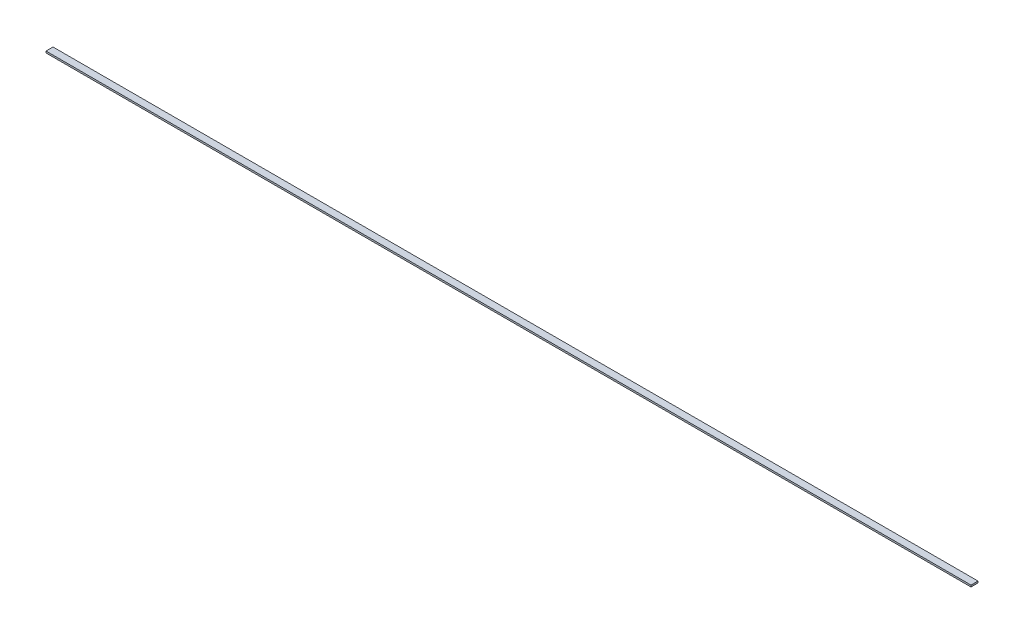
ISO-10303-21;
HEADER;
FILE_DESCRIPTION(('STEP AP214'),'2;1');
FILE_NAME('part.step','',(''),(''),'','','');
FILE_SCHEMA(('AUTOMOTIVE_DESIGN { 1 0 10303 214 1 1 1 1 }'));
ENDSEC;
DATA;
#1=APPLICATION_CONTEXT('core data for automotive mechanical design processes');
#2=APPLICATION_PROTOCOL_DEFINITION('international standard','automotive_design',2000,#1);
#3=PRODUCT_CONTEXT('',#1,'mechanical');
#4=PRODUCT('Part','Part','',(#3));
#5=PRODUCT_RELATED_PRODUCT_CATEGORY('part','',(#4));
#6=PRODUCT_DEFINITION_FORMATION('','',#4);
#7=PRODUCT_DEFINITION_CONTEXT('part definition',#1,'design');
#8=PRODUCT_DEFINITION('design','',#6,#7);
#9=PRODUCT_DEFINITION_SHAPE('','',#8);
#10=(LENGTH_UNIT() NAMED_UNIT(*) SI_UNIT(.MILLI.,.METRE.));
#11=(NAMED_UNIT(*) PLANE_ANGLE_UNIT() SI_UNIT($,.RADIAN.));
#12=(NAMED_UNIT(*) SI_UNIT($,.STERADIAN.) SOLID_ANGLE_UNIT());
#13=UNCERTAINTY_MEASURE_WITH_UNIT(LENGTH_MEASURE(1.E-05),#10,'distance_accuracy_value','');
#14=(GEOMETRIC_REPRESENTATION_CONTEXT(3) GLOBAL_UNCERTAINTY_ASSIGNED_CONTEXT((#13)) GLOBAL_UNIT_ASSIGNED_CONTEXT((#10,
#11,#12)) REPRESENTATION_CONTEXT('',''));
#15=CARTESIAN_POINT('',(0.,0.,0.));
#16=DIRECTION('',(0.,0.,1.));
#17=DIRECTION('',(1.,0.,0.));
#18=AXIS2_PLACEMENT_3D('',#15,#16,#17);
#19=CARTESIAN_POINT('',(-298.612862547289,0.545,4.47919293820933));
#20=DIRECTION('',(-1.,0.,0.));
#21=DIRECTION('',(0.,0.,1.));
#22=AXIS2_PLACEMENT_3D('',#19,#20,#21);
#23=PLANE('',#22);
#24=DIRECTION('',(0.,0.,-1.));
#25=VECTOR('',#24,1.);
#26=CARTESIAN_POINT('',(-298.612862547289,-0.545,4.47919293820933));
#27=LINE('',#26,#25);
#28=CARTESIAN_POINT('',(-298.612862547289,-0.545,4.47919293820933));
#29=VERTEX_POINT('',#28);
#30=CARTESIAN_POINT('',(-298.612862547289,-0.545,0.));
#31=VERTEX_POINT('',#30);
#32=EDGE_CURVE('E103',#29,#31,#27,.T.);
#33=ORIENTED_EDGE('',*,*,#32,.F.);
#34=DIRECTION('',(0.,-1.,0.));
#35=VECTOR('',#34,1.);
#36=CARTESIAN_POINT('',(-298.612862547289,0.545,4.47919293820933));
#37=LINE('',#36,#35);
#38=CARTESIAN_POINT('',(-298.612862547289,0.545,4.47919293820933));
#39=VERTEX_POINT('',#38);
#40=EDGE_CURVE('E11',#39,#29,#37,.T.);
#41=ORIENTED_EDGE('',*,*,#40,.F.);
#42=DIRECTION('',(0.,0.,-1.));
#43=VECTOR('',#42,1.);
#44=CARTESIAN_POINT('',(-298.612862547289,0.545,4.47919293820933));
#45=LINE('',#44,#43);
#46=CARTESIAN_POINT('',(-298.612862547289,0.545,0.));
#47=VERTEX_POINT('',#46);
#48=EDGE_CURVE('E97',#39,#47,#45,.T.);
#49=ORIENTED_EDGE('',*,*,#48,.T.);
#50=DIRECTION('',(0.,-1.,0.));
#51=VECTOR('',#50,1.);
#52=CARTESIAN_POINT('',(-298.612862547289,0.545,0.));
#53=LINE('',#52,#51);
#54=EDGE_CURVE('E42',#47,#31,#53,.T.);
#55=ORIENTED_EDGE('',*,*,#54,.T.);
#56=EDGE_LOOP('',(#33,#41,#49,#55));
#57=FACE_BOUND('',#56,.T.);
#58=ADVANCED_FACE('F39',(#57),#23,.T.);
#59=CARTESIAN_POINT('',(293.387137452711,0.545,4.47919293820933));
#60=DIRECTION('',(0.,0.,1.));
#61=DIRECTION('',(1.,0.,0.));
#62=AXIS2_PLACEMENT_3D('',#59,#60,#61);
#63=PLANE('',#62);
#64=DIRECTION('',(-1.,0.,0.));
#65=VECTOR('',#64,1.);
#66=CARTESIAN_POINT('',(293.387137452711,-0.545,4.47919293820933));
#67=LINE('',#66,#65);
#68=CARTESIAN_POINT('',(293.387137452711,-0.545,4.47919293820933));
#69=VERTEX_POINT('',#68);
#70=EDGE_CURVE('E99',#69,#29,#67,.T.);
#71=ORIENTED_EDGE('',*,*,#70,.F.);
#72=DIRECTION('',(0.,-1.,0.));
#73=VECTOR('',#72,1.);
#74=CARTESIAN_POINT('',(293.387137452711,0.545,4.47919293820933));
#75=LINE('',#74,#73);
#76=CARTESIAN_POINT('',(293.387137452711,0.545,4.47919293820933));
#77=VERTEX_POINT('',#76);
#78=EDGE_CURVE('E48',#77,#69,#75,.T.);
#79=ORIENTED_EDGE('',*,*,#78,.F.);
#80=DIRECTION('',(-1.,0.,0.));
#81=VECTOR('',#80,1.);
#82=CARTESIAN_POINT('',(293.387137452711,0.545,4.47919293820933));
#83=LINE('',#82,#81);
#84=EDGE_CURVE('E94',#77,#39,#83,.T.);
#85=ORIENTED_EDGE('',*,*,#84,.T.);
#86=ORIENTED_EDGE('',*,*,#40,.T.);
#87=EDGE_LOOP('',(#71,#79,#85,#86));
#88=FACE_BOUND('',#87,.T.);
#89=ADVANCED_FACE('F113',(#88),#63,.T.);
#90=CARTESIAN_POINT('',(293.387137452711,0.545,0.));
#91=DIRECTION('',(1.,0.,0.));
#92=DIRECTION('',(0.,0.,-1.));
#93=AXIS2_PLACEMENT_3D('',#90,#91,#92);
#94=PLANE('',#93);
#95=DIRECTION('',(0.,0.,1.));
#96=VECTOR('',#95,1.);
#97=CARTESIAN_POINT('',(293.387137452711,-0.545,0.));
#98=LINE('',#97,#96);
#99=CARTESIAN_POINT('',(293.387137452711,-0.545,0.));
#100=VERTEX_POINT('',#99);
#101=EDGE_CURVE('E89',#100,#69,#98,.T.);
#102=ORIENTED_EDGE('',*,*,#101,.F.);
#103=DIRECTION('',(0.,-1.,0.));
#104=VECTOR('',#103,1.);
#105=CARTESIAN_POINT('',(293.387137452711,0.545,0.));
#106=LINE('',#105,#104);
#107=CARTESIAN_POINT('',(293.387137452711,0.545,0.));
#108=VERTEX_POINT('',#107);
#109=EDGE_CURVE('E84',#108,#100,#106,.T.);
#110=ORIENTED_EDGE('',*,*,#109,.F.);
#111=DIRECTION('',(0.,0.,1.));
#112=VECTOR('',#111,1.);
#113=CARTESIAN_POINT('',(293.387137452711,0.545,0.));
#114=LINE('',#113,#112);
#115=EDGE_CURVE('E87',#108,#77,#114,.T.);
#116=ORIENTED_EDGE('',*,*,#115,.T.);
#117=ORIENTED_EDGE('',*,*,#78,.T.);
#118=EDGE_LOOP('',(#102,#110,#116,#117));
#119=FACE_BOUND('',#118,.T.);
#120=ADVANCED_FACE('F86',(#119),#94,.T.);
#121=CARTESIAN_POINT('',(-298.612862547289,0.545,0.));
#122=DIRECTION('',(0.,0.,-1.));
#123=DIRECTION('',(-1.,0.,0.));
#124=AXIS2_PLACEMENT_3D('',#121,#122,#123);
#125=PLANE('',#124);
#126=DIRECTION('',(1.,0.,0.));
#127=VECTOR('',#126,1.);
#128=CARTESIAN_POINT('',(-298.612862547289,-0.545,0.));
#129=LINE('',#128,#127);
#130=EDGE_CURVE('E106',#31,#100,#129,.T.);
#131=ORIENTED_EDGE('',*,*,#130,.F.);
#132=ORIENTED_EDGE('',*,*,#54,.F.);
#133=DIRECTION('',(1.,0.,0.));
#134=VECTOR('',#133,1.);
#135=CARTESIAN_POINT('',(-298.612862547289,0.545,0.));
#136=LINE('',#135,#134);
#137=EDGE_CURVE('E93',#47,#108,#136,.T.);
#138=ORIENTED_EDGE('',*,*,#137,.T.);
#139=ORIENTED_EDGE('',*,*,#109,.T.);
#140=EDGE_LOOP('',(#131,#132,#138,#139));
#141=FACE_BOUND('',#140,.T.);
#142=ADVANCED_FACE('F96',(#141),#125,.T.);
#143=CARTESIAN_POINT('',(0.,0.545,0.));
#144=DIRECTION('',(0.,-1.,0.));
#145=DIRECTION('',(0.,0.,-1.));
#146=AXIS2_PLACEMENT_3D('',#143,#144,#145);
#147=PLANE('',#146);
#148=ORIENTED_EDGE('',*,*,#48,.F.);
#149=ORIENTED_EDGE('',*,*,#84,.F.);
#150=ORIENTED_EDGE('',*,*,#115,.F.);
#151=ORIENTED_EDGE('',*,*,#137,.F.);
#152=EDGE_LOOP('',(#148,#149,#150,#151));
#153=FACE_BOUND('',#152,.T.);
#154=ADVANCED_FACE('F92',(#153),#147,.F.);
#155=CARTESIAN_POINT('',(0.,-0.545,0.));
#156=DIRECTION('',(0.,-1.,0.));
#157=DIRECTION('',(0.,0.,-1.));
#158=AXIS2_PLACEMENT_3D('',#155,#156,#157);
#159=PLANE('',#158);
#160=ORIENTED_EDGE('',*,*,#32,.T.);
#161=ORIENTED_EDGE('',*,*,#130,.T.);
#162=ORIENTED_EDGE('',*,*,#101,.T.);
#163=ORIENTED_EDGE('',*,*,#70,.T.);
#164=EDGE_LOOP('',(#160,#161,#162,#163));
#165=FACE_BOUND('',#164,.T.);
#166=ADVANCED_FACE('F112',(#165),#159,.T.);
#167=CLOSED_SHELL('',(#58,#89,#120,#142,#154,#166));
#168=MANIFOLD_SOLID_BREP('B2',#167);
#169=ADVANCED_BREP_SHAPE_REPRESENTATION('',(#18,#168),#14);
#170=SHAPE_DEFINITION_REPRESENTATION(#9,#169);
ENDSEC;
END-ISO-10303-21;
